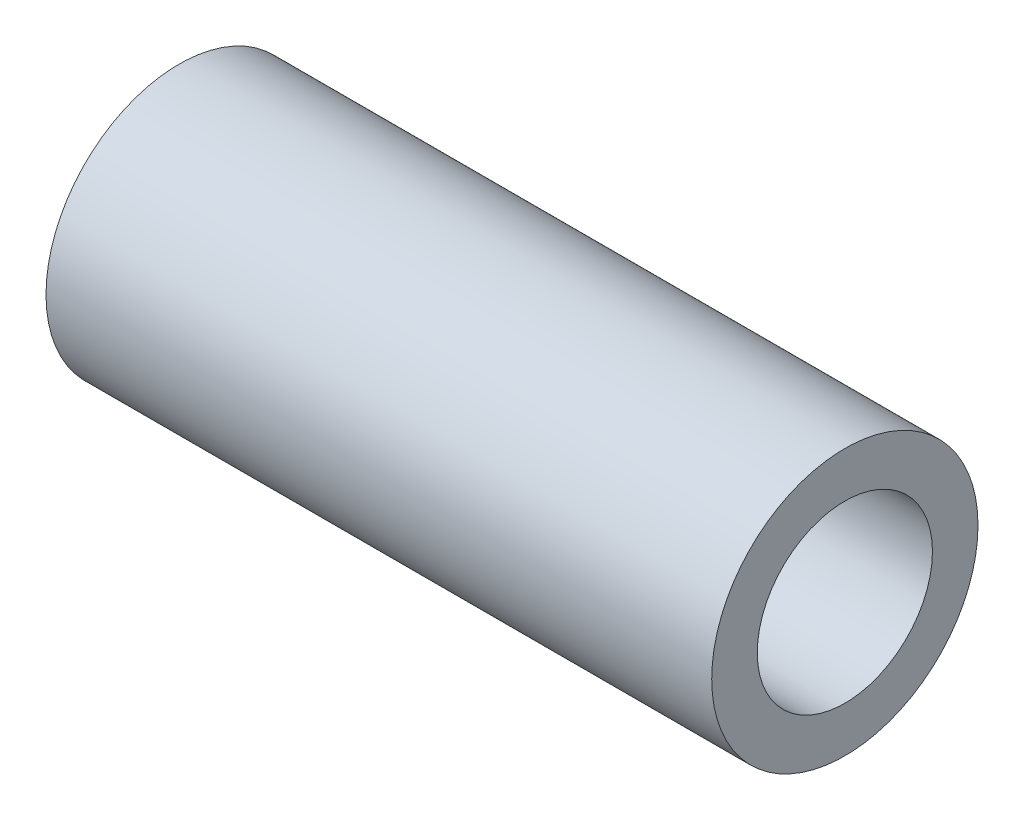
ISO-10303-21;
HEADER;
FILE_DESCRIPTION(('STEP AP214'),'2;1');
FILE_NAME('part.step','',(''),(''),'','','');
FILE_SCHEMA(('AUTOMOTIVE_DESIGN { 1 0 10303 214 1 1 1 1 }'));
ENDSEC;
DATA;
#1=APPLICATION_CONTEXT('core data for automotive mechanical design processes');
#2=APPLICATION_PROTOCOL_DEFINITION('international standard','automotive_design',2000,#1);
#3=PRODUCT_CONTEXT('',#1,'mechanical');
#4=PRODUCT('Part','Part','',(#3));
#5=PRODUCT_RELATED_PRODUCT_CATEGORY('part','',(#4));
#6=PRODUCT_DEFINITION_FORMATION('','',#4);
#7=PRODUCT_DEFINITION_CONTEXT('part definition',#1,'design');
#8=PRODUCT_DEFINITION('design','',#6,#7);
#9=PRODUCT_DEFINITION_SHAPE('','',#8);
#10=(LENGTH_UNIT() NAMED_UNIT(*) SI_UNIT(.MILLI.,.METRE.));
#11=(NAMED_UNIT(*) PLANE_ANGLE_UNIT() SI_UNIT($,.RADIAN.));
#12=(NAMED_UNIT(*) SI_UNIT($,.STERADIAN.) SOLID_ANGLE_UNIT());
#13=UNCERTAINTY_MEASURE_WITH_UNIT(LENGTH_MEASURE(1.E-05),#10,'distance_accuracy_value','');
#14=(GEOMETRIC_REPRESENTATION_CONTEXT(3) GLOBAL_UNCERTAINTY_ASSIGNED_CONTEXT((#13)) GLOBAL_UNIT_ASSIGNED_CONTEXT((#10,
#11,#12)) REPRESENTATION_CONTEXT('',''));
#15=CARTESIAN_POINT('',(0.,0.,0.));
#16=DIRECTION('',(0.,0.,1.));
#17=DIRECTION('',(1.,0.,0.));
#18=AXIS2_PLACEMENT_3D('',#15,#16,#17);
#19=CARTESIAN_POINT('',(120.65,0.,0.));
#20=DIRECTION('',(1.,0.,0.));
#21=DIRECTION('',(0.,0.,-1.));
#22=AXIS2_PLACEMENT_3D('',#19,#20,#21);
#23=PLANE('',#22);
#24=CARTESIAN_POINT('',(120.65,0.,0.));
#25=DIRECTION('',(1.,0.,0.));
#26=DIRECTION('',(0.,0.,-1.));
#27=AXIS2_PLACEMENT_3D('',#24,#25,#26);
#28=CIRCLE('',#27,24.13);
#29=CARTESIAN_POINT('',(120.65,0.,-24.13));
#30=VERTEX_POINT('',#29);
#31=EDGE_CURVE('E10',#30,#30,#28,.T.);
#32=ORIENTED_EDGE('',*,*,#31,.T.);
#33=EDGE_LOOP('',(#32));
#34=FACE_BOUND('',#33,.T.);
#35=CARTESIAN_POINT('',(120.65,0.,0.));
#36=DIRECTION('',(1.,0.,0.));
#37=DIRECTION('',(0.,0.,-1.));
#38=AXIS2_PLACEMENT_3D('',#35,#36,#37);
#39=CIRCLE('',#38,15.875);
#40=CARTESIAN_POINT('',(120.65,0.,-15.875));
#41=VERTEX_POINT('',#40);
#42=EDGE_CURVE('E56',#41,#41,#39,.T.);
#43=ORIENTED_EDGE('',*,*,#42,.F.);
#44=EDGE_LOOP('',(#43));
#45=FACE_BOUND('',#44,.T.);
#46=ADVANCED_FACE('F43',(#34,#45),#23,.T.);
#47=CARTESIAN_POINT('',(0.,0.,0.));
#48=DIRECTION('',(1.,0.,0.));
#49=DIRECTION('',(0.,0.,-1.));
#50=AXIS2_PLACEMENT_3D('',#47,#48,#49);
#51=PLANE('',#50);
#52=CARTESIAN_POINT('',(0.,0.,0.));
#53=DIRECTION('',(1.,0.,0.));
#54=DIRECTION('',(0.,0.,-1.));
#55=AXIS2_PLACEMENT_3D('',#52,#53,#54);
#56=CIRCLE('',#55,24.13);
#57=CARTESIAN_POINT('',(0.,0.,-24.13));
#58=VERTEX_POINT('',#57);
#59=EDGE_CURVE('E47',#58,#58,#56,.T.);
#60=ORIENTED_EDGE('',*,*,#59,.F.);
#61=EDGE_LOOP('',(#60));
#62=FACE_BOUND('',#61,.T.);
#63=CARTESIAN_POINT('',(0.,0.,0.));
#64=DIRECTION('',(1.,0.,0.));
#65=DIRECTION('',(0.,0.,-1.));
#66=AXIS2_PLACEMENT_3D('',#63,#64,#65);
#67=CIRCLE('',#66,15.875);
#68=CARTESIAN_POINT('',(0.,0.,-15.875));
#69=VERTEX_POINT('',#68);
#70=EDGE_CURVE('E58',#69,#69,#67,.T.);
#71=ORIENTED_EDGE('',*,*,#70,.T.);
#72=EDGE_LOOP('',(#71));
#73=FACE_BOUND('',#72,.T.);
#74=ADVANCED_FACE('F70',(#62,#73),#51,.F.);
#75=CARTESIAN_POINT('',(120.65,0.,0.));
#76=DIRECTION('',(-1.,0.,0.));
#77=DIRECTION('',(0.,0.,1.));
#78=AXIS2_PLACEMENT_3D('',#75,#76,#77);
#79=CYLINDRICAL_SURFACE('',#78,24.13);
#80=ORIENTED_EDGE('',*,*,#31,.F.);
#81=EDGE_LOOP('',(#80));
#82=FACE_BOUND('',#81,.T.);
#83=ORIENTED_EDGE('',*,*,#59,.T.);
#84=EDGE_LOOP('',(#83));
#85=FACE_BOUND('',#84,.T.);
#86=ADVANCED_FACE('F45',(#82,#85),#79,.T.);
#87=CARTESIAN_POINT('',(120.65,0.,0.));
#88=DIRECTION('',(-1.,0.,0.));
#89=DIRECTION('',(0.,0.,1.));
#90=AXIS2_PLACEMENT_3D('',#87,#88,#89);
#91=CYLINDRICAL_SURFACE('',#90,15.875);
#92=ORIENTED_EDGE('',*,*,#42,.T.);
#93=EDGE_LOOP('',(#92));
#94=FACE_BOUND('',#93,.T.);
#95=ORIENTED_EDGE('',*,*,#70,.F.);
#96=EDGE_LOOP('',(#95));
#97=FACE_BOUND('',#96,.T.);
#98=ADVANCED_FACE('F66',(#94,#97),#91,.F.);
#99=CLOSED_SHELL('',(#46,#74,#86,#98));
#100=MANIFOLD_SOLID_BREP('B2',#99);
#101=ADVANCED_BREP_SHAPE_REPRESENTATION('',(#18,#100),#14);
#102=SHAPE_DEFINITION_REPRESENTATION(#9,#101);
ENDSEC;
END-ISO-10303-21;
